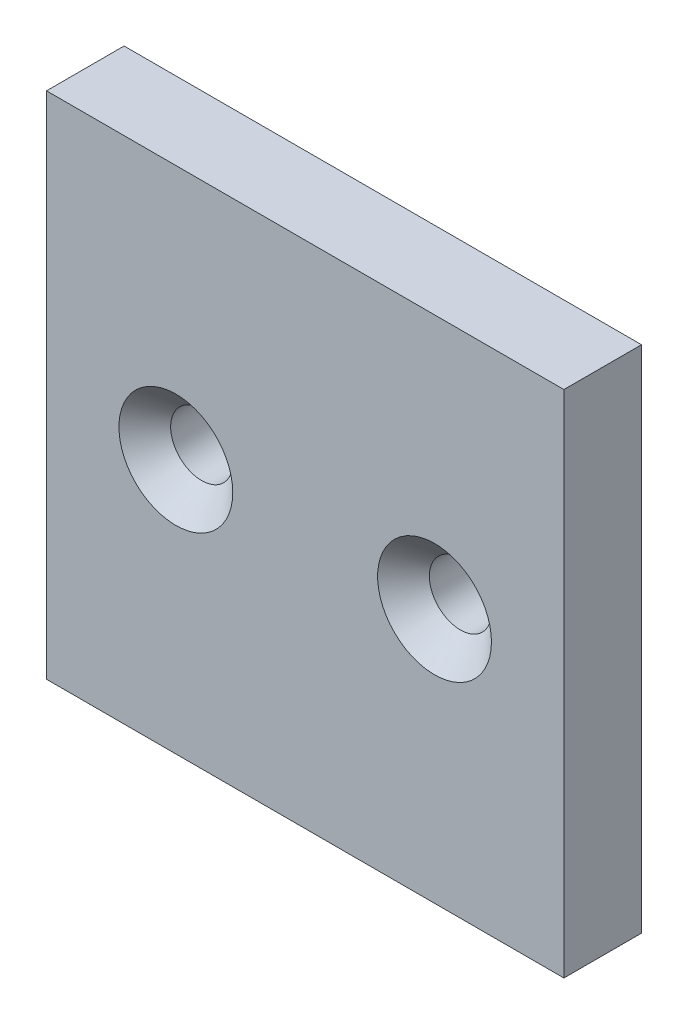
ISO-10303-21;
HEADER;
FILE_DESCRIPTION(('STEP AP214'),'2;1');
FILE_NAME('part.step','',(''),(''),'','','');
FILE_SCHEMA(('AUTOMOTIVE_DESIGN { 1 0 10303 214 1 1 1 1 }'));
ENDSEC;
DATA;
#1=APPLICATION_CONTEXT('core data for automotive mechanical design processes');
#2=APPLICATION_PROTOCOL_DEFINITION('international standard','automotive_design',2000,#1);
#3=PRODUCT_CONTEXT('',#1,'mechanical');
#4=PRODUCT('Part','Part','',(#3));
#5=PRODUCT_RELATED_PRODUCT_CATEGORY('part','',(#4));
#6=PRODUCT_DEFINITION_FORMATION('','',#4);
#7=PRODUCT_DEFINITION_CONTEXT('part definition',#1,'design');
#8=PRODUCT_DEFINITION('design','',#6,#7);
#9=PRODUCT_DEFINITION_SHAPE('','',#8);
#10=(LENGTH_UNIT() NAMED_UNIT(*) SI_UNIT(.MILLI.,.METRE.));
#11=(NAMED_UNIT(*) PLANE_ANGLE_UNIT() SI_UNIT($,.RADIAN.));
#12=(NAMED_UNIT(*) SI_UNIT($,.STERADIAN.) SOLID_ANGLE_UNIT());
#13=UNCERTAINTY_MEASURE_WITH_UNIT(LENGTH_MEASURE(1.E-05),#10,'distance_accuracy_value','');
#14=(GEOMETRIC_REPRESENTATION_CONTEXT(3) GLOBAL_UNCERTAINTY_ASSIGNED_CONTEXT((#13)) GLOBAL_UNIT_ASSIGNED_CONTEXT((#10,
#11,#12)) REPRESENTATION_CONTEXT('',''));
#15=CARTESIAN_POINT('',(0.,0.,0.));
#16=DIRECTION('',(0.,0.,1.));
#17=DIRECTION('',(1.,0.,0.));
#18=AXIS2_PLACEMENT_3D('',#15,#16,#17);
#19=CARTESIAN_POINT('',(0.,0.,3.));
#20=DIRECTION('',(1.,0.,0.));
#21=DIRECTION('',(0.,0.,-1.));
#22=AXIS2_PLACEMENT_3D('',#19,#20,#21);
#23=PLANE('',#22);
#24=DIRECTION('',(0.,-1.,0.));
#25=VECTOR('',#24,1.);
#26=CARTESIAN_POINT('',(0.,0.,0.));
#27=LINE('',#26,#25);
#28=CARTESIAN_POINT('',(0.,19.7,0.));
#29=VERTEX_POINT('',#28);
#30=CARTESIAN_POINT('',(0.,0.,0.));
#31=VERTEX_POINT('',#30);
#32=EDGE_CURVE('E97',#29,#31,#27,.T.);
#33=ORIENTED_EDGE('',*,*,#32,.T.);
#34=DIRECTION('',(0.,0.,-1.));
#35=VECTOR('',#34,1.);
#36=CARTESIAN_POINT('',(0.,0.,3.));
#37=LINE('',#36,#35);
#38=CARTESIAN_POINT('',(0.,0.,3.));
#39=VERTEX_POINT('',#38);
#40=EDGE_CURVE('E11',#39,#31,#37,.T.);
#41=ORIENTED_EDGE('',*,*,#40,.F.);
#42=DIRECTION('',(0.,-1.,0.));
#43=VECTOR('',#42,1.);
#44=CARTESIAN_POINT('',(0.,0.,3.));
#45=LINE('',#44,#43);
#46=CARTESIAN_POINT('',(0.,19.7,3.));
#47=VERTEX_POINT('',#46);
#48=EDGE_CURVE('E85',#47,#39,#45,.T.);
#49=ORIENTED_EDGE('',*,*,#48,.F.);
#50=DIRECTION('',(0.,0.,-1.));
#51=VECTOR('',#50,1.);
#52=CARTESIAN_POINT('',(0.,19.7,3.));
#53=LINE('',#52,#51);
#54=EDGE_CURVE('E93',#47,#29,#53,.T.);
#55=ORIENTED_EDGE('',*,*,#54,.T.);
#56=EDGE_LOOP('',(#33,#41,#49,#55));
#57=FACE_BOUND('',#56,.T.);
#58=ADVANCED_FACE('F34',(#57),#23,.F.);
#59=CARTESIAN_POINT('',(0.,0.,3.));
#60=DIRECTION('',(0.,1.,0.));
#61=DIRECTION('',(0.,0.,1.));
#62=AXIS2_PLACEMENT_3D('',#59,#60,#61);
#63=PLANE('',#62);
#64=DIRECTION('',(1.,0.,0.));
#65=VECTOR('',#64,1.);
#66=CARTESIAN_POINT('',(0.,0.,0.));
#67=LINE('',#66,#65);
#68=CARTESIAN_POINT('',(20.,0.,0.));
#69=VERTEX_POINT('',#68);
#70=EDGE_CURVE('E89',#31,#69,#67,.T.);
#71=ORIENTED_EDGE('',*,*,#70,.T.);
#72=DIRECTION('',(0.,0.,-1.));
#73=VECTOR('',#72,1.);
#74=CARTESIAN_POINT('',(20.,0.,3.));
#75=LINE('',#74,#73);
#76=CARTESIAN_POINT('',(20.,0.,3.));
#77=VERTEX_POINT('',#76);
#78=EDGE_CURVE('E42',#77,#69,#75,.T.);
#79=ORIENTED_EDGE('',*,*,#78,.F.);
#80=DIRECTION('',(1.,0.,0.));
#81=VECTOR('',#80,1.);
#82=CARTESIAN_POINT('',(0.,0.,3.));
#83=LINE('',#82,#81);
#84=EDGE_CURVE('E80',#39,#77,#83,.T.);
#85=ORIENTED_EDGE('',*,*,#84,.F.);
#86=ORIENTED_EDGE('',*,*,#40,.T.);
#87=EDGE_LOOP('',(#71,#79,#85,#86));
#88=FACE_BOUND('',#87,.T.);
#89=ADVANCED_FACE('F88',(#88),#63,.F.);
#90=CARTESIAN_POINT('',(20.,0.,3.));
#91=DIRECTION('',(-1.,0.,0.));
#92=DIRECTION('',(0.,0.,1.));
#93=AXIS2_PLACEMENT_3D('',#90,#91,#92);
#94=PLANE('',#93);
#95=DIRECTION('',(0.,1.,0.));
#96=VECTOR('',#95,1.);
#97=CARTESIAN_POINT('',(20.,0.,0.));
#98=LINE('',#97,#96);
#99=CARTESIAN_POINT('',(20.,19.7,0.));
#100=VERTEX_POINT('',#99);
#101=EDGE_CURVE('E67',#69,#100,#98,.T.);
#102=ORIENTED_EDGE('',*,*,#101,.T.);
#103=DIRECTION('',(0.,0.,-1.));
#104=VECTOR('',#103,1.);
#105=CARTESIAN_POINT('',(20.,19.7,3.));
#106=LINE('',#105,#104);
#107=CARTESIAN_POINT('',(20.,19.7,3.));
#108=VERTEX_POINT('',#107);
#109=EDGE_CURVE('E90',#108,#100,#106,.T.);
#110=ORIENTED_EDGE('',*,*,#109,.F.);
#111=DIRECTION('',(0.,1.,0.));
#112=VECTOR('',#111,1.);
#113=CARTESIAN_POINT('',(20.,0.,3.));
#114=LINE('',#113,#112);
#115=EDGE_CURVE('E83',#77,#108,#114,.T.);
#116=ORIENTED_EDGE('',*,*,#115,.F.);
#117=ORIENTED_EDGE('',*,*,#78,.T.);
#118=EDGE_LOOP('',(#102,#110,#116,#117));
#119=FACE_BOUND('',#118,.T.);
#120=ADVANCED_FACE('F91',(#119),#94,.F.);
#121=CARTESIAN_POINT('',(0.,19.7,3.));
#122=DIRECTION('',(0.,-1.,0.));
#123=DIRECTION('',(0.,0.,-1.));
#124=AXIS2_PLACEMENT_3D('',#121,#122,#123);
#125=PLANE('',#124);
#126=DIRECTION('',(-1.,0.,0.));
#127=VECTOR('',#126,1.);
#128=CARTESIAN_POINT('',(0.,19.7,0.));
#129=LINE('',#128,#127);
#130=EDGE_CURVE('E73',#100,#29,#129,.T.);
#131=ORIENTED_EDGE('',*,*,#130,.T.);
#132=ORIENTED_EDGE('',*,*,#54,.F.);
#133=DIRECTION('',(-1.,0.,0.));
#134=VECTOR('',#133,1.);
#135=CARTESIAN_POINT('',(0.,19.7,3.));
#136=LINE('',#135,#134);
#137=EDGE_CURVE('E50',#108,#47,#136,.T.);
#138=ORIENTED_EDGE('',*,*,#137,.F.);
#139=ORIENTED_EDGE('',*,*,#109,.T.);
#140=EDGE_LOOP('',(#131,#132,#138,#139));
#141=FACE_BOUND('',#140,.T.);
#142=ADVANCED_FACE('F105',(#141),#125,.F.);
#143=CARTESIAN_POINT('',(0.,0.,3.));
#144=DIRECTION('',(0.,0.,-1.));
#145=DIRECTION('',(-1.,0.,0.));
#146=AXIS2_PLACEMENT_3D('',#143,#144,#145);
#147=PLANE('',#146);
#148=CARTESIAN_POINT('',(5.,9.85,3.));
#149=DIRECTION('',(0.,0.,1.));
#150=DIRECTION('',(1.,0.,0.));
#151=AXIS2_PLACEMENT_3D('',#148,#149,#150);
#152=CIRCLE('',#151,2.2);
#153=CARTESIAN_POINT('',(7.2,9.85,3.));
#154=VERTEX_POINT('',#153);
#155=EDGE_CURVE('E125',#154,#154,#152,.T.);
#156=ORIENTED_EDGE('',*,*,#155,.F.);
#157=EDGE_LOOP('',(#156));
#158=FACE_BOUND('',#157,.T.);
#159=CARTESIAN_POINT('',(15.,9.85,3.));
#160=DIRECTION('',(0.,0.,1.));
#161=DIRECTION('',(1.,0.,0.));
#162=AXIS2_PLACEMENT_3D('',#159,#160,#161);
#163=CIRCLE('',#162,2.2);
#164=CARTESIAN_POINT('',(17.2,9.85,3.));
#165=VERTEX_POINT('',#164);
#166=EDGE_CURVE('E116',#165,#165,#163,.T.);
#167=ORIENTED_EDGE('',*,*,#166,.F.);
#168=EDGE_LOOP('',(#167));
#169=FACE_BOUND('',#168,.T.);
#170=ORIENTED_EDGE('',*,*,#48,.T.);
#171=ORIENTED_EDGE('',*,*,#84,.T.);
#172=ORIENTED_EDGE('',*,*,#115,.T.);
#173=ORIENTED_EDGE('',*,*,#137,.T.);
#174=EDGE_LOOP('',(#170,#171,#172,#173));
#175=FACE_BOUND('',#174,.T.);
#176=ADVANCED_FACE('F81',(#158,#169,#175),#147,.F.);
#177=CARTESIAN_POINT('',(0.,0.,0.));
#178=DIRECTION('',(0.,0.,-1.));
#179=DIRECTION('',(-1.,0.,0.));
#180=AXIS2_PLACEMENT_3D('',#177,#178,#179);
#181=PLANE('',#180);
#182=CARTESIAN_POINT('',(5.,9.85,0.));
#183=DIRECTION('',(0.,0.,1.));
#184=DIRECTION('',(1.,0.,0.));
#185=AXIS2_PLACEMENT_3D('',#182,#183,#184);
#186=CIRCLE('',#185,1.2);
#187=CARTESIAN_POINT('',(6.2,9.85,0.));
#188=VERTEX_POINT('',#187);
#189=EDGE_CURVE('E119',#188,#188,#186,.T.);
#190=ORIENTED_EDGE('',*,*,#189,.T.);
#191=EDGE_LOOP('',(#190));
#192=FACE_BOUND('',#191,.T.);
#193=CARTESIAN_POINT('',(15.,9.85,0.));
#194=DIRECTION('',(0.,0.,1.));
#195=DIRECTION('',(1.,0.,0.));
#196=AXIS2_PLACEMENT_3D('',#193,#194,#195);
#197=CIRCLE('',#196,1.2);
#198=CARTESIAN_POINT('',(16.2,9.85,0.));
#199=VERTEX_POINT('',#198);
#200=EDGE_CURVE('E100',#199,#199,#197,.T.);
#201=ORIENTED_EDGE('',*,*,#200,.T.);
#202=EDGE_LOOP('',(#201));
#203=FACE_BOUND('',#202,.T.);
#204=ORIENTED_EDGE('',*,*,#32,.F.);
#205=ORIENTED_EDGE('',*,*,#130,.F.);
#206=ORIENTED_EDGE('',*,*,#101,.F.);
#207=ORIENTED_EDGE('',*,*,#70,.F.);
#208=EDGE_LOOP('',(#204,#205,#206,#207));
#209=FACE_BOUND('',#208,.T.);
#210=ADVANCED_FACE('F108',(#192,#203,#209),#181,.T.);
#211=CARTESIAN_POINT('',(15.,9.85,3.));
#212=DIRECTION('',(0.,0.,1.));
#213=DIRECTION('',(1.,0.,0.));
#214=AXIS2_PLACEMENT_3D('',#211,#212,#213);
#215=CYLINDRICAL_SURFACE('',#214,1.19999999999999);
#216=ORIENTED_EDGE('',*,*,#200,.F.);
#217=EDGE_LOOP('',(#216));
#218=FACE_BOUND('',#217,.T.);
#219=CARTESIAN_POINT('',(15.,9.85,2.));
#220=DIRECTION('',(0.,0.,1.));
#221=DIRECTION('',(1.,0.,0.));
#222=AXIS2_PLACEMENT_3D('',#219,#220,#221);
#223=CIRCLE('',#222,1.19999999999999);
#224=CARTESIAN_POINT('',(16.2,9.85,2.));
#225=VERTEX_POINT('',#224);
#226=EDGE_CURVE('E113',#225,#225,#223,.T.);
#227=ORIENTED_EDGE('',*,*,#226,.T.);
#228=EDGE_LOOP('',(#227));
#229=FACE_BOUND('',#228,.T.);
#230=ADVANCED_FACE('F139',(#218,#229),#215,.F.);
#231=CARTESIAN_POINT('',(15.,9.85,3.));
#232=DIRECTION('',(0.,0.,1.));
#233=DIRECTION('',(1.,0.,0.));
#234=AXIS2_PLACEMENT_3D('',#231,#232,#233);
#235=CONICAL_SURFACE('',#234,2.2,0.785398163397453);
#236=ORIENTED_EDGE('',*,*,#226,.F.);
#237=EDGE_LOOP('',(#236));
#238=FACE_BOUND('',#237,.T.);
#239=ORIENTED_EDGE('',*,*,#166,.T.);
#240=EDGE_LOOP('',(#239));
#241=FACE_BOUND('',#240,.T.);
#242=ADVANCED_FACE('F136',(#238,#241),#235,.F.);
#243=CARTESIAN_POINT('',(5.,9.85,3.));
#244=DIRECTION('',(0.,0.,1.));
#245=DIRECTION('',(1.,0.,0.));
#246=AXIS2_PLACEMENT_3D('',#243,#244,#245);
#247=CYLINDRICAL_SURFACE('',#246,1.19999999999999);
#248=ORIENTED_EDGE('',*,*,#189,.F.);
#249=EDGE_LOOP('',(#248));
#250=FACE_BOUND('',#249,.T.);
#251=CARTESIAN_POINT('',(5.,9.85,2.));
#252=DIRECTION('',(0.,0.,1.));
#253=DIRECTION('',(1.,0.,0.));
#254=AXIS2_PLACEMENT_3D('',#251,#252,#253);
#255=CIRCLE('',#254,1.19999999999999);
#256=CARTESIAN_POINT('',(6.19999999999999,9.85,2.));
#257=VERTEX_POINT('',#256);
#258=EDGE_CURVE('E122',#257,#257,#255,.T.);
#259=ORIENTED_EDGE('',*,*,#258,.T.);
#260=EDGE_LOOP('',(#259));
#261=FACE_BOUND('',#260,.T.);
#262=ADVANCED_FACE('F138',(#250,#261),#247,.F.);
#263=CARTESIAN_POINT('',(5.,9.85,3.));
#264=DIRECTION('',(0.,0.,1.));
#265=DIRECTION('',(1.,0.,0.));
#266=AXIS2_PLACEMENT_3D('',#263,#264,#265);
#267=CONICAL_SURFACE('',#266,2.2,0.785398163397453);
#268=ORIENTED_EDGE('',*,*,#258,.F.);
#269=EDGE_LOOP('',(#268));
#270=FACE_BOUND('',#269,.T.);
#271=ORIENTED_EDGE('',*,*,#155,.T.);
#272=EDGE_LOOP('',(#271));
#273=FACE_BOUND('',#272,.T.);
#274=ADVANCED_FACE('F129',(#270,#273),#267,.F.);
#275=CLOSED_SHELL('',(#58,#89,#120,#142,#176,#210,#230,#242,#262,#274));
#276=MANIFOLD_SOLID_BREP('B2',#275);
#277=ADVANCED_BREP_SHAPE_REPRESENTATION('',(#18,#276),#14);
#278=SHAPE_DEFINITION_REPRESENTATION(#9,#277);
ENDSEC;
END-ISO-10303-21;
